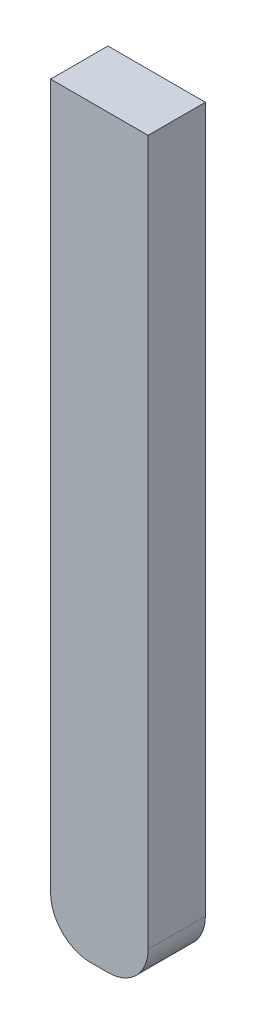
ISO-10303-21;
HEADER;
FILE_DESCRIPTION(('STEP AP214'),'2;1');
FILE_NAME('part.step','',(''),(''),'','','');
FILE_SCHEMA(('AUTOMOTIVE_DESIGN { 1 0 10303 214 1 1 1 1 }'));
ENDSEC;
DATA;
#1=APPLICATION_CONTEXT('core data for automotive mechanical design processes');
#2=APPLICATION_PROTOCOL_DEFINITION('international standard','automotive_design',2000,#1);
#3=PRODUCT_CONTEXT('',#1,'mechanical');
#4=PRODUCT('Part','Part','',(#3));
#5=PRODUCT_RELATED_PRODUCT_CATEGORY('part','',(#4));
#6=PRODUCT_DEFINITION_FORMATION('','',#4);
#7=PRODUCT_DEFINITION_CONTEXT('part definition',#1,'design');
#8=PRODUCT_DEFINITION('design','',#6,#7);
#9=PRODUCT_DEFINITION_SHAPE('','',#8);
#10=(LENGTH_UNIT() NAMED_UNIT(*) SI_UNIT(.MILLI.,.METRE.));
#11=(NAMED_UNIT(*) PLANE_ANGLE_UNIT() SI_UNIT($,.RADIAN.));
#12=(NAMED_UNIT(*) SI_UNIT($,.STERADIAN.) SOLID_ANGLE_UNIT());
#13=UNCERTAINTY_MEASURE_WITH_UNIT(LENGTH_MEASURE(1.E-05),#10,'distance_accuracy_value','');
#14=(GEOMETRIC_REPRESENTATION_CONTEXT(3) GLOBAL_UNCERTAINTY_ASSIGNED_CONTEXT((#13)) GLOBAL_UNIT_ASSIGNED_CONTEXT((#10,
#11,#12)) REPRESENTATION_CONTEXT('',''));
#15=CARTESIAN_POINT('',(0.,0.,0.));
#16=DIRECTION('',(0.,0.,1.));
#17=DIRECTION('',(1.,0.,0.));
#18=AXIS2_PLACEMENT_3D('',#15,#16,#17);
#19=CARTESIAN_POINT('',(16.17274519616,6.2,-17.69102915295));
#20=DIRECTION('',(0.,0.,1.));
#21=DIRECTION('',(1.,0.,0.));
#22=AXIS2_PLACEMENT_3D('',#19,#20,#21);
#23=PLANE('',#22);
#24=CARTESIAN_POINT('',(16.52274519616,0.05,-17.69102915295));
#25=DIRECTION('',(0.,0.,1.));
#26=DIRECTION('',(1.,0.,0.));
#27=AXIS2_PLACEMENT_3D('',#24,#25,#26);
#28=CIRCLE('',#27,0.35);
#29=CARTESIAN_POINT('',(16.17274519616,0.0499999999999998,-17.69102915295));
#30=VERTEX_POINT('',#29);
#31=CARTESIAN_POINT('',(16.52274519616,-0.3,-17.69102915295));
#32=VERTEX_POINT('',#31);
#33=EDGE_CURVE('E123',#30,#32,#28,.T.);
#34=ORIENTED_EDGE('',*,*,#33,.F.);
#35=DIRECTION('',(0.,1.,0.));
#36=VECTOR('',#35,1.);
#37=CARTESIAN_POINT('',(16.17274519616,6.2,-17.69102915295));
#38=LINE('',#37,#36);
#39=CARTESIAN_POINT('',(16.17274519616,6.2,-17.69102915295));
#40=VERTEX_POINT('',#39);
#41=EDGE_CURVE('E87',#30,#40,#38,.T.);
#42=ORIENTED_EDGE('',*,*,#41,.T.);
#43=DIRECTION('',(1.,0.,0.));
#44=VECTOR('',#43,1.);
#45=CARTESIAN_POINT('',(0.,6.2,-17.69102915295));
#46=LINE('',#45,#44);
#47=CARTESIAN_POINT('',(17.02274519616,6.2,-17.69102915295));
#48=VERTEX_POINT('',#47);
#49=EDGE_CURVE('E67',#48,#40,#46,.F.);
#50=ORIENTED_EDGE('',*,*,#49,.F.);
#51=DIRECTION('',(0.,1.,0.));
#52=VECTOR('',#51,1.);
#53=CARTESIAN_POINT('',(17.02274519616,6.2,-17.69102915295));
#54=LINE('',#53,#52);
#55=CARTESIAN_POINT('',(17.02274519616,0.05,-17.69102915295));
#56=VERTEX_POINT('',#55);
#57=EDGE_CURVE('E143',#48,#56,#54,.F.);
#58=ORIENTED_EDGE('',*,*,#57,.T.);
#59=CARTESIAN_POINT('',(16.67274519616,0.05,-17.69102915295));
#60=DIRECTION('',(0.,0.,-1.));
#61=DIRECTION('',(-1.,0.,0.));
#62=AXIS2_PLACEMENT_3D('',#59,#60,#61);
#63=CIRCLE('',#62,0.35);
#64=CARTESIAN_POINT('',(16.67274519616,-0.3,-17.69102915295));
#65=VERTEX_POINT('',#64);
#66=EDGE_CURVE('E20',#65,#56,#63,.F.);
#67=ORIENTED_EDGE('',*,*,#66,.F.);
#68=DIRECTION('',(1.,0.,0.));
#69=VECTOR('',#68,1.);
#70=CARTESIAN_POINT('',(0.,-0.3,-17.69102915295));
#71=LINE('',#70,#69);
#72=EDGE_CURVE('E124',#65,#32,#71,.F.);
#73=ORIENTED_EDGE('',*,*,#72,.T.);
#74=EDGE_LOOP('',(#34,#42,#50,#58,#67,#73));
#75=FACE_BOUND('',#74,.T.);
#76=ADVANCED_FACE('F17',(#75),#23,.F.);
#77=CARTESIAN_POINT('',(0.,6.2,0.));
#78=DIRECTION('',(0.,1.,0.));
#79=DIRECTION('',(0.,0.,1.));
#80=AXIS2_PLACEMENT_3D('',#77,#78,#79);
#81=PLANE('',#80);
#82=DIRECTION('',(0.,0.,1.));
#83=VECTOR('',#82,1.);
#84=CARTESIAN_POINT('',(17.02274519616,6.2,-17.69102915295));
#85=LINE('',#84,#83);
#86=CARTESIAN_POINT('',(17.02274519616,6.2,-17.19102915295));
#87=VERTEX_POINT('',#86);
#88=EDGE_CURVE('E141',#87,#48,#85,.F.);
#89=ORIENTED_EDGE('',*,*,#88,.T.);
#90=ORIENTED_EDGE('',*,*,#49,.T.);
#91=DIRECTION('',(0.,0.,-1.));
#92=VECTOR('',#91,1.);
#93=CARTESIAN_POINT('',(16.17274519616,6.2,-17.69102915295));
#94=LINE('',#93,#92);
#95=CARTESIAN_POINT('',(16.17274519616,6.2,-17.19102915295));
#96=VERTEX_POINT('',#95);
#97=EDGE_CURVE('E90',#40,#96,#94,.F.);
#98=ORIENTED_EDGE('',*,*,#97,.T.);
#99=DIRECTION('',(-1.,0.,0.));
#100=VECTOR('',#99,1.);
#101=CARTESIAN_POINT('',(16.17274519616,6.2,-17.19102915295));
#102=LINE('',#101,#100);
#103=EDGE_CURVE('E77',#96,#87,#102,.F.);
#104=ORIENTED_EDGE('',*,*,#103,.T.);
#105=EDGE_LOOP('',(#89,#90,#98,#104));
#106=FACE_BOUND('',#105,.T.);
#107=ADVANCED_FACE('F91',(#106),#81,.T.);
#108=CARTESIAN_POINT('',(17.02274519616,6.2,-17.69102915295));
#109=DIRECTION('',(-1.,0.,0.));
#110=DIRECTION('',(0.,0.,1.));
#111=AXIS2_PLACEMENT_3D('',#108,#109,#110);
#112=PLANE('',#111);
#113=DIRECTION('',(0.,0.,-1.));
#114=VECTOR('',#113,1.);
#115=CARTESIAN_POINT('',(17.02274519616,0.05,-17.69102915295));
#116=LINE('',#115,#114);
#117=CARTESIAN_POINT('',(17.02274519616,0.05,-17.19102915295));
#118=VERTEX_POINT('',#117);
#119=EDGE_CURVE('E139',#56,#118,#116,.F.);
#120=ORIENTED_EDGE('',*,*,#119,.F.);
#121=ORIENTED_EDGE('',*,*,#57,.F.);
#122=ORIENTED_EDGE('',*,*,#88,.F.);
#123=DIRECTION('',(0.,1.,0.));
#124=VECTOR('',#123,1.);
#125=CARTESIAN_POINT('',(17.02274519616,6.2,-17.19102915295));
#126=LINE('',#125,#124);
#127=EDGE_CURVE('E84',#87,#118,#126,.F.);
#128=ORIENTED_EDGE('',*,*,#127,.T.);
#129=EDGE_LOOP('',(#120,#121,#122,#128));
#130=FACE_BOUND('',#129,.T.);
#131=ADVANCED_FACE('F114',(#130),#112,.F.);
#132=CARTESIAN_POINT('',(16.67274519616,0.05,-17.69102915295));
#133=DIRECTION('',(0.,0.,-1.));
#134=DIRECTION('',(-1.,0.,0.));
#135=AXIS2_PLACEMENT_3D('',#132,#133,#134);
#136=CYLINDRICAL_SURFACE('',#135,0.35);
#137=ORIENTED_EDGE('',*,*,#66,.T.);
#138=ORIENTED_EDGE('',*,*,#119,.T.);
#139=CARTESIAN_POINT('',(16.67274519616,0.05,-17.19102915295));
#140=DIRECTION('',(0.,0.,-1.));
#141=DIRECTION('',(-1.,0.,0.));
#142=AXIS2_PLACEMENT_3D('',#139,#140,#141);
#143=CIRCLE('',#142,0.35);
#144=CARTESIAN_POINT('',(16.67274519616,-0.3,-17.19102915295));
#145=VERTEX_POINT('',#144);
#146=EDGE_CURVE('E157',#118,#145,#143,.T.);
#147=ORIENTED_EDGE('',*,*,#146,.T.);
#148=DIRECTION('',(0.,0.,1.));
#149=VECTOR('',#148,1.);
#150=CARTESIAN_POINT('',(16.67274519616,-0.3,0.));
#151=LINE('',#150,#149);
#152=EDGE_CURVE('E137',#145,#65,#151,.F.);
#153=ORIENTED_EDGE('',*,*,#152,.T.);
#154=EDGE_LOOP('',(#137,#138,#147,#153));
#155=FACE_BOUND('',#154,.T.);
#156=ADVANCED_FACE('F110',(#155),#136,.T.);
#157=CARTESIAN_POINT('',(0.,-0.3,0.));
#158=DIRECTION('',(0.,1.,0.));
#159=DIRECTION('',(0.,0.,1.));
#160=AXIS2_PLACEMENT_3D('',#157,#158,#159);
#161=PLANE('',#160);
#162=DIRECTION('',(0.,0.,1.));
#163=VECTOR('',#162,1.);
#164=CARTESIAN_POINT('',(16.52274519616,-0.3,-17.69102915295));
#165=LINE('',#164,#163);
#166=CARTESIAN_POINT('',(16.52274519616,-0.3,-17.19102915295));
#167=VERTEX_POINT('',#166);
#168=EDGE_CURVE('E92',#32,#167,#165,.T.);
#169=ORIENTED_EDGE('',*,*,#168,.F.);
#170=ORIENTED_EDGE('',*,*,#72,.F.);
#171=ORIENTED_EDGE('',*,*,#152,.F.);
#172=DIRECTION('',(-1.,0.,0.));
#173=VECTOR('',#172,1.);
#174=CARTESIAN_POINT('',(16.17274519616,-0.3,-17.19102915295));
#175=LINE('',#174,#173);
#176=EDGE_CURVE('E156',#145,#167,#175,.T.);
#177=ORIENTED_EDGE('',*,*,#176,.T.);
#178=EDGE_LOOP('',(#169,#170,#171,#177));
#179=FACE_BOUND('',#178,.T.);
#180=ADVANCED_FACE('F104',(#179),#161,.F.);
#181=CARTESIAN_POINT('',(16.52274519616,0.05,-17.69102915295));
#182=DIRECTION('',(0.,0.,1.));
#183=DIRECTION('',(1.,0.,0.));
#184=AXIS2_PLACEMENT_3D('',#181,#182,#183);
#185=CYLINDRICAL_SURFACE('',#184,0.35);
#186=CARTESIAN_POINT('',(16.52274519616,0.05,-17.19102915295));
#187=DIRECTION('',(0.,0.,1.));
#188=DIRECTION('',(1.,0.,0.));
#189=AXIS2_PLACEMENT_3D('',#186,#187,#188);
#190=CIRCLE('',#189,0.35);
#191=CARTESIAN_POINT('',(16.17274519616,0.0499999999999998,-17.19102915295));
#192=VERTEX_POINT('',#191);
#193=EDGE_CURVE('E26',#167,#192,#190,.F.);
#194=ORIENTED_EDGE('',*,*,#193,.T.);
#195=DIRECTION('',(0.,0.,-1.));
#196=VECTOR('',#195,1.);
#197=CARTESIAN_POINT('',(16.17274519616,0.0499999999999997,-17.69102915295));
#198=LINE('',#197,#196);
#199=EDGE_CURVE('E34',#192,#30,#198,.T.);
#200=ORIENTED_EDGE('',*,*,#199,.T.);
#201=ORIENTED_EDGE('',*,*,#33,.T.);
#202=ORIENTED_EDGE('',*,*,#168,.T.);
#203=EDGE_LOOP('',(#194,#200,#201,#202));
#204=FACE_BOUND('',#203,.T.);
#205=ADVANCED_FACE('F96',(#204),#185,.T.);
#206=CARTESIAN_POINT('',(16.17274519616,6.2,-17.69102915295));
#207=DIRECTION('',(1.,0.,0.));
#208=DIRECTION('',(0.,0.,-1.));
#209=AXIS2_PLACEMENT_3D('',#206,#207,#208);
#210=PLANE('',#209);
#211=ORIENTED_EDGE('',*,*,#199,.F.);
#212=DIRECTION('',(0.,1.,0.));
#213=VECTOR('',#212,1.);
#214=CARTESIAN_POINT('',(16.17274519616,6.2,-17.19102915295));
#215=LINE('',#214,#213);
#216=EDGE_CURVE('E11',#192,#96,#215,.T.);
#217=ORIENTED_EDGE('',*,*,#216,.T.);
#218=ORIENTED_EDGE('',*,*,#97,.F.);
#219=ORIENTED_EDGE('',*,*,#41,.F.);
#220=EDGE_LOOP('',(#211,#217,#218,#219));
#221=FACE_BOUND('',#220,.T.);
#222=ADVANCED_FACE('F94',(#221),#210,.F.);
#223=CARTESIAN_POINT('',(16.17274519616,6.2,-17.19102915295));
#224=DIRECTION('',(0.,0.,-1.));
#225=DIRECTION('',(-1.,0.,0.));
#226=AXIS2_PLACEMENT_3D('',#223,#224,#225);
#227=PLANE('',#226);
#228=ORIENTED_EDGE('',*,*,#193,.F.);
#229=ORIENTED_EDGE('',*,*,#176,.F.);
#230=ORIENTED_EDGE('',*,*,#146,.F.);
#231=ORIENTED_EDGE('',*,*,#127,.F.);
#232=ORIENTED_EDGE('',*,*,#103,.F.);
#233=ORIENTED_EDGE('',*,*,#216,.F.);
#234=EDGE_LOOP('',(#228,#229,#230,#231,#232,#233));
#235=FACE_BOUND('',#234,.T.);
#236=ADVANCED_FACE('F80',(#235),#227,.F.);
#237=CLOSED_SHELL('',(#76,#107,#131,#156,#180,#205,#222,#236));
#238=MANIFOLD_SOLID_BREP('B1',#237);
#239=ADVANCED_BREP_SHAPE_REPRESENTATION('',(#18,#238),#14);
#240=SHAPE_DEFINITION_REPRESENTATION(#9,#239);
ENDSEC;
END-ISO-10303-21;
